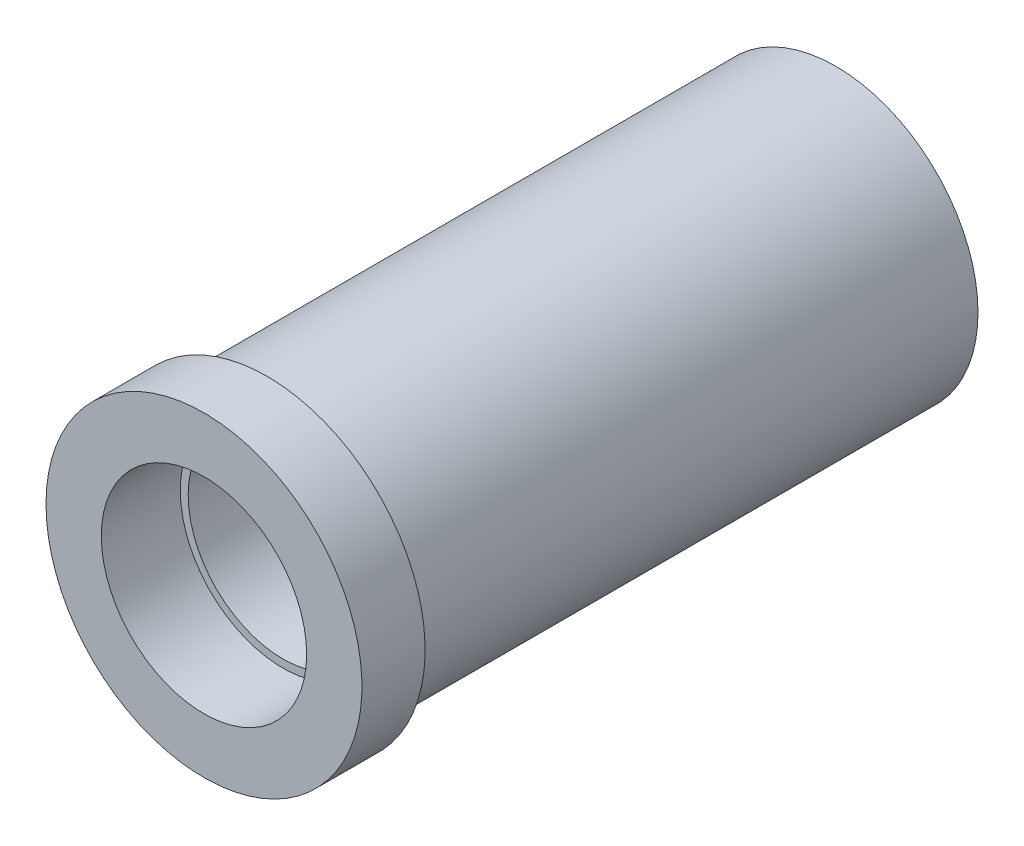
ISO-10303-21;
HEADER;
FILE_DESCRIPTION(('STEP AP214'),'2;1');
FILE_NAME('part.step','',(''),(''),'','','');
FILE_SCHEMA(('AUTOMOTIVE_DESIGN { 1 0 10303 214 1 1 1 1 }'));
ENDSEC;
DATA;
#1=APPLICATION_CONTEXT('core data for automotive mechanical design processes');
#2=APPLICATION_PROTOCOL_DEFINITION('international standard','automotive_design',2000,#1);
#3=PRODUCT_CONTEXT('',#1,'mechanical');
#4=PRODUCT('Part','Part','',(#3));
#5=PRODUCT_RELATED_PRODUCT_CATEGORY('part','',(#4));
#6=PRODUCT_DEFINITION_FORMATION('','',#4);
#7=PRODUCT_DEFINITION_CONTEXT('part definition',#1,'design');
#8=PRODUCT_DEFINITION('design','',#6,#7);
#9=PRODUCT_DEFINITION_SHAPE('','',#8);
#10=(LENGTH_UNIT() NAMED_UNIT(*) SI_UNIT(.MILLI.,.METRE.));
#11=(NAMED_UNIT(*) PLANE_ANGLE_UNIT() SI_UNIT($,.RADIAN.));
#12=(NAMED_UNIT(*) SI_UNIT($,.STERADIAN.) SOLID_ANGLE_UNIT());
#13=UNCERTAINTY_MEASURE_WITH_UNIT(LENGTH_MEASURE(1.E-05),#10,'distance_accuracy_value','');
#14=(GEOMETRIC_REPRESENTATION_CONTEXT(3) GLOBAL_UNCERTAINTY_ASSIGNED_CONTEXT((#13)) GLOBAL_UNIT_ASSIGNED_CONTEXT((#10,
#11,#12)) REPRESENTATION_CONTEXT('',''));
#15=CARTESIAN_POINT('',(0.,0.,0.));
#16=DIRECTION('',(0.,0.,1.));
#17=DIRECTION('',(1.,0.,0.));
#18=AXIS2_PLACEMENT_3D('',#15,#16,#17);
#19=CARTESIAN_POINT('',(0.,0.,-40.));
#20=DIRECTION('',(0.,0.,1.));
#21=DIRECTION('',(-1.,0.,0.));
#22=AXIS2_PLACEMENT_3D('',#19,#20,#21);
#23=CYLINDRICAL_SURFACE('',#22,9.);
#24=CARTESIAN_POINT('',(0.,0.,-40.));
#25=DIRECTION('',(0.,0.,1.));
#26=DIRECTION('',(1.,0.,0.));
#27=AXIS2_PLACEMENT_3D('',#24,#25,#26);
#28=CIRCLE('',#27,9.);
#29=CARTESIAN_POINT('',(9.,0.,-40.));
#30=VERTEX_POINT('',#29);
#31=EDGE_CURVE('E41',#30,#30,#28,.T.);
#32=ORIENTED_EDGE('',*,*,#31,.T.);
#33=EDGE_LOOP('',(#32));
#34=FACE_BOUND('',#33,.T.);
#35=CARTESIAN_POINT('',(0.,0.,-4.));
#36=DIRECTION('',(0.,0.,-1.));
#37=DIRECTION('',(-1.,0.,0.));
#38=AXIS2_PLACEMENT_3D('',#35,#36,#37);
#39=CIRCLE('',#38,9.);
#40=CARTESIAN_POINT('',(-9.,0.,-4.));
#41=VERTEX_POINT('',#40);
#42=EDGE_CURVE('E10',#41,#41,#39,.T.);
#43=ORIENTED_EDGE('',*,*,#42,.T.);
#44=EDGE_LOOP('',(#43));
#45=FACE_BOUND('',#44,.T.);
#46=ADVANCED_FACE('F35',(#34,#45),#23,.T.);
#47=CARTESIAN_POINT('',(0.,0.,-40.));
#48=DIRECTION('',(0.,0.,1.));
#49=DIRECTION('',(-1.,0.,0.));
#50=AXIS2_PLACEMENT_3D('',#47,#48,#49);
#51=CYLINDRICAL_SURFACE('',#50,6.);
#52=CARTESIAN_POINT('',(0.,0.,-35.));
#53=DIRECTION('',(0.,0.,1.));
#54=DIRECTION('',(1.,0.,0.));
#55=AXIS2_PLACEMENT_3D('',#52,#53,#54);
#56=CIRCLE('',#55,6.);
#57=CARTESIAN_POINT('',(6.,0.,-35.));
#58=VERTEX_POINT('',#57);
#59=EDGE_CURVE('E45',#58,#58,#56,.T.);
#60=ORIENTED_EDGE('',*,*,#59,.F.);
#61=EDGE_LOOP('',(#60));
#62=FACE_BOUND('',#61,.T.);
#63=CARTESIAN_POINT('',(0.,0.,-5.));
#64=DIRECTION('',(0.,0.,-1.));
#65=DIRECTION('',(-1.,0.,0.));
#66=AXIS2_PLACEMENT_3D('',#63,#64,#65);
#67=CIRCLE('',#66,6.);
#68=CARTESIAN_POINT('',(-6.,0.,-5.));
#69=VERTEX_POINT('',#68);
#70=EDGE_CURVE('E55',#69,#69,#67,.T.);
#71=ORIENTED_EDGE('',*,*,#70,.F.);
#72=EDGE_LOOP('',(#71));
#73=FACE_BOUND('',#72,.T.);
#74=ADVANCED_FACE('F92',(#62,#73),#51,.F.);
#75=CARTESIAN_POINT('',(0.,0.,-40.));
#76=DIRECTION('',(0.,0.,-1.));
#77=DIRECTION('',(1.,0.,0.));
#78=AXIS2_PLACEMENT_3D('',#75,#76,#77);
#79=PLANE('',#78);
#80=CARTESIAN_POINT('',(0.,0.,-40.));
#81=DIRECTION('',(0.,0.,1.));
#82=DIRECTION('',(1.,0.,0.));
#83=AXIS2_PLACEMENT_3D('',#80,#81,#82);
#84=CIRCLE('',#83,6.5);
#85=CARTESIAN_POINT('',(6.5,0.,-40.));
#86=VERTEX_POINT('',#85);
#87=EDGE_CURVE('E53',#86,#86,#84,.T.);
#88=ORIENTED_EDGE('',*,*,#87,.T.);
#89=EDGE_LOOP('',(#88));
#90=FACE_BOUND('',#89,.T.);
#91=ORIENTED_EDGE('',*,*,#31,.F.);
#92=EDGE_LOOP('',(#91));
#93=FACE_BOUND('',#92,.T.);
#94=ADVANCED_FACE('F96',(#90,#93),#79,.T.);
#95=CARTESIAN_POINT('',(0.,0.,0.));
#96=DIRECTION('',(0.,0.,-1.));
#97=DIRECTION('',(1.,0.,0.));
#98=AXIS2_PLACEMENT_3D('',#95,#96,#97);
#99=PLANE('',#98);
#100=CARTESIAN_POINT('',(0.,0.,0.));
#101=DIRECTION('',(0.,0.,-1.));
#102=DIRECTION('',(-1.,0.,0.));
#103=AXIS2_PLACEMENT_3D('',#100,#101,#102);
#104=CIRCLE('',#103,6.5);
#105=CARTESIAN_POINT('',(-6.5,0.,0.));
#106=VERTEX_POINT('',#105);
#107=EDGE_CURVE('E62',#106,#106,#104,.T.);
#108=ORIENTED_EDGE('',*,*,#107,.T.);
#109=EDGE_LOOP('',(#108));
#110=FACE_BOUND('',#109,.T.);
#111=CARTESIAN_POINT('',(0.,0.,0.));
#112=DIRECTION('',(0.,0.,-1.));
#113=DIRECTION('',(-1.,0.,0.));
#114=AXIS2_PLACEMENT_3D('',#111,#112,#113);
#115=CIRCLE('',#114,10.);
#116=CARTESIAN_POINT('',(-10.,0.,0.));
#117=VERTEX_POINT('',#116);
#118=EDGE_CURVE('E70',#117,#117,#115,.T.);
#119=ORIENTED_EDGE('',*,*,#118,.F.);
#120=EDGE_LOOP('',(#119));
#121=FACE_BOUND('',#120,.T.);
#122=ADVANCED_FACE('F89',(#110,#121),#99,.F.);
#123=CARTESIAN_POINT('',(0.,0.,-35.));
#124=DIRECTION('',(0.,0.,-1.));
#125=DIRECTION('',(1.,0.,0.));
#126=AXIS2_PLACEMENT_3D('',#123,#124,#125);
#127=CYLINDRICAL_SURFACE('',#126,6.5);
#128=CARTESIAN_POINT('',(0.,0.,-35.));
#129=DIRECTION('',(0.,0.,1.));
#130=DIRECTION('',(1.,0.,0.));
#131=AXIS2_PLACEMENT_3D('',#128,#129,#130);
#132=CIRCLE('',#131,6.5);
#133=CARTESIAN_POINT('',(6.5,0.,-35.));
#134=VERTEX_POINT('',#133);
#135=EDGE_CURVE('E50',#134,#134,#132,.T.);
#136=ORIENTED_EDGE('',*,*,#135,.T.);
#137=EDGE_LOOP('',(#136));
#138=FACE_BOUND('',#137,.T.);
#139=ORIENTED_EDGE('',*,*,#87,.F.);
#140=EDGE_LOOP('',(#139));
#141=FACE_BOUND('',#140,.T.);
#142=ADVANCED_FACE('F75',(#138,#141),#127,.F.);
#143=CARTESIAN_POINT('',(0.,0.,-35.));
#144=DIRECTION('',(0.,0.,-1.));
#145=DIRECTION('',(1.,0.,0.));
#146=AXIS2_PLACEMENT_3D('',#143,#144,#145);
#147=PLANE('',#146);
#148=ORIENTED_EDGE('',*,*,#59,.T.);
#149=EDGE_LOOP('',(#148));
#150=FACE_BOUND('',#149,.T.);
#151=ORIENTED_EDGE('',*,*,#135,.F.);
#152=EDGE_LOOP('',(#151));
#153=FACE_BOUND('',#152,.T.);
#154=ADVANCED_FACE('F78',(#150,#153),#147,.T.);
#155=CARTESIAN_POINT('',(0.,0.,-5.));
#156=DIRECTION('',(0.,0.,1.));
#157=DIRECTION('',(-1.,0.,0.));
#158=AXIS2_PLACEMENT_3D('',#155,#156,#157);
#159=CYLINDRICAL_SURFACE('',#158,6.5);
#160=CARTESIAN_POINT('',(0.,0.,-5.));
#161=DIRECTION('',(0.,0.,-1.));
#162=DIRECTION('',(-1.,0.,0.));
#163=AXIS2_PLACEMENT_3D('',#160,#161,#162);
#164=CIRCLE('',#163,6.5);
#165=CARTESIAN_POINT('',(-6.5,0.,-5.));
#166=VERTEX_POINT('',#165);
#167=EDGE_CURVE('E57',#166,#166,#164,.T.);
#168=ORIENTED_EDGE('',*,*,#167,.T.);
#169=EDGE_LOOP('',(#168));
#170=FACE_BOUND('',#169,.T.);
#171=ORIENTED_EDGE('',*,*,#107,.F.);
#172=EDGE_LOOP('',(#171));
#173=FACE_BOUND('',#172,.T.);
#174=ADVANCED_FACE('F80',(#170,#173),#159,.F.);
#175=CARTESIAN_POINT('',(0.,0.,-5.));
#176=DIRECTION('',(0.,0.,1.));
#177=DIRECTION('',(-1.,0.,0.));
#178=AXIS2_PLACEMENT_3D('',#175,#176,#177);
#179=PLANE('',#178);
#180=ORIENTED_EDGE('',*,*,#70,.T.);
#181=EDGE_LOOP('',(#180));
#182=FACE_BOUND('',#181,.T.);
#183=ORIENTED_EDGE('',*,*,#167,.F.);
#184=EDGE_LOOP('',(#183));
#185=FACE_BOUND('',#184,.T.);
#186=ADVANCED_FACE('F87',(#182,#185),#179,.T.);
#187=CARTESIAN_POINT('',(0.,0.,-4.));
#188=DIRECTION('',(0.,0.,1.));
#189=DIRECTION('',(-1.,0.,0.));
#190=AXIS2_PLACEMENT_3D('',#187,#188,#189);
#191=CYLINDRICAL_SURFACE('',#190,10.);
#192=CARTESIAN_POINT('',(0.,0.,-4.));
#193=DIRECTION('',(0.,0.,-1.));
#194=DIRECTION('',(-1.,0.,0.));
#195=AXIS2_PLACEMENT_3D('',#192,#193,#194);
#196=CIRCLE('',#195,10.);
#197=CARTESIAN_POINT('',(-10.,0.,-4.));
#198=VERTEX_POINT('',#197);
#199=EDGE_CURVE('E67',#198,#198,#196,.T.);
#200=ORIENTED_EDGE('',*,*,#199,.F.);
#201=EDGE_LOOP('',(#200));
#202=FACE_BOUND('',#201,.T.);
#203=ORIENTED_EDGE('',*,*,#118,.T.);
#204=EDGE_LOOP('',(#203));
#205=FACE_BOUND('',#204,.T.);
#206=ADVANCED_FACE('F120',(#202,#205),#191,.T.);
#207=CARTESIAN_POINT('',(0.,0.,-4.));
#208=DIRECTION('',(0.,0.,1.));
#209=DIRECTION('',(-1.,0.,0.));
#210=AXIS2_PLACEMENT_3D('',#207,#208,#209);
#211=PLANE('',#210);
#212=ORIENTED_EDGE('',*,*,#42,.F.);
#213=EDGE_LOOP('',(#212));
#214=FACE_BOUND('',#213,.T.);
#215=ORIENTED_EDGE('',*,*,#199,.T.);
#216=EDGE_LOOP('',(#215));
#217=FACE_BOUND('',#216,.T.);
#218=ADVANCED_FACE('F118',(#214,#217),#211,.F.);
#219=CLOSED_SHELL('',(#46,#74,#94,#122,#142,#154,#174,#186,#206,#218));
#220=MANIFOLD_SOLID_BREP('B2',#219);
#221=ADVANCED_BREP_SHAPE_REPRESENTATION('',(#18,#220),#14);
#222=SHAPE_DEFINITION_REPRESENTATION(#9,#221);
ENDSEC;
END-ISO-10303-21;
